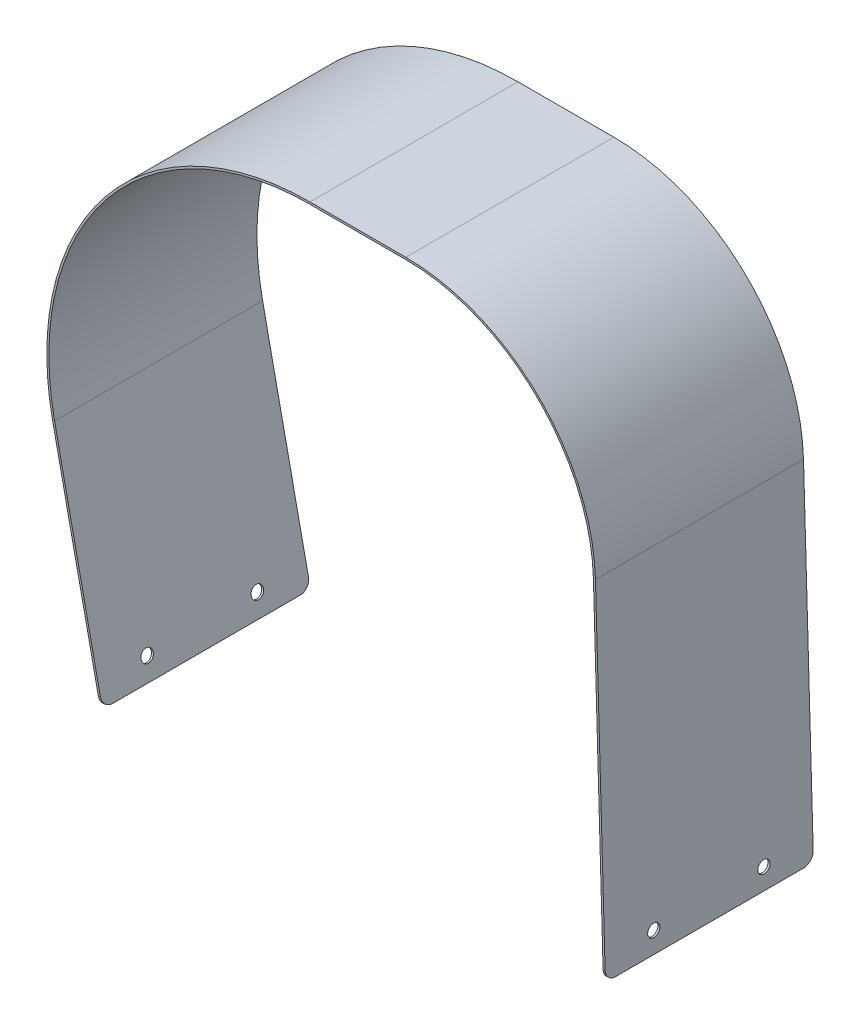
ISO-10303-21;
HEADER;
FILE_DESCRIPTION(('STEP AP214'),'2;1');
FILE_NAME('part.step','',(''),(''),'','','');
FILE_SCHEMA(('AUTOMOTIVE_DESIGN { 1 0 10303 214 1 1 1 1 }'));
ENDSEC;
DATA;
#1=APPLICATION_CONTEXT('core data for automotive mechanical design processes');
#2=APPLICATION_PROTOCOL_DEFINITION('international standard','automotive_design',2000,#1);
#3=PRODUCT_CONTEXT('',#1,'mechanical');
#4=PRODUCT('Part','Part','',(#3));
#5=PRODUCT_RELATED_PRODUCT_CATEGORY('part','',(#4));
#6=PRODUCT_DEFINITION_FORMATION('','',#4);
#7=PRODUCT_DEFINITION_CONTEXT('part definition',#1,'design');
#8=PRODUCT_DEFINITION('design','',#6,#7);
#9=PRODUCT_DEFINITION_SHAPE('','',#8);
#10=(LENGTH_UNIT() NAMED_UNIT(*) SI_UNIT(.MILLI.,.METRE.));
#11=(NAMED_UNIT(*) PLANE_ANGLE_UNIT() SI_UNIT($,.RADIAN.));
#12=(NAMED_UNIT(*) SI_UNIT($,.STERADIAN.) SOLID_ANGLE_UNIT());
#13=UNCERTAINTY_MEASURE_WITH_UNIT(LENGTH_MEASURE(1.E-05),#10,'distance_accuracy_value','');
#14=(GEOMETRIC_REPRESENTATION_CONTEXT(3) GLOBAL_UNCERTAINTY_ASSIGNED_CONTEXT((#13)) GLOBAL_UNIT_ASSIGNED_CONTEXT((#10,
#11,#12)) REPRESENTATION_CONTEXT('',''));
#15=CARTESIAN_POINT('',(0.,0.,0.));
#16=DIRECTION('',(0.,0.,1.));
#17=DIRECTION('',(1.,0.,0.));
#18=AXIS2_PLACEMENT_3D('',#15,#16,#17);
#19=CARTESIAN_POINT('',(135.043499474033,-127.971047058245,102.));
#20=DIRECTION('',(-0.999580775707346,-0.0289529417555443,0.));
#21=DIRECTION('',(0.0289529417555443,-0.999580775707346,0.));
#22=AXIS2_PLACEMENT_3D('',#19,#20,#21);
#23=PLANE('',#22);
#24=CARTESIAN_POINT('',(134.753970056478,-117.975239301171,24.));
#25=DIRECTION('',(0.999580775707346,0.0289529417555443,0.));
#26=DIRECTION('',(-0.0289529417555443,0.999580775707346,0.));
#27=AXIS2_PLACEMENT_3D('',#24,#25,#26);
#28=CIRCLE('',#27,3.00000000000001);
#29=CARTESIAN_POINT('',(134.667111231211,-114.976496974049,24.));
#30=VERTEX_POINT('',#29);
#31=EDGE_CURVE('E338',#30,#30,#28,.T.);
#32=ORIENTED_EDGE('',*,*,#31,.F.);
#33=EDGE_LOOP('',(#32));
#34=FACE_BOUND('',#33,.T.);
#35=DIRECTION('',(-0.0289529417555443,0.999580775707346,0.));
#36=VECTOR('',#35,1.);
#37=CARTESIAN_POINT('',(135.043499474033,-127.971047058245,102.));
#38=LINE('',#37,#36);
#39=CARTESIAN_POINT('',(134.898734765256,-122.973143179708,102.));
#40=VERTEX_POINT('',#39);
#41=CARTESIAN_POINT('',(130.158141981134,40.6926235832663,102.));
#42=VERTEX_POINT('',#41);
#43=EDGE_CURVE('E183',#40,#42,#38,.T.);
#44=ORIENTED_EDGE('',*,*,#43,.F.);
#45=CARTESIAN_POINT('',(134.898734765256,-122.973143179708,97.));
#46=DIRECTION('',(-0.999580775707346,-0.0289529417555443,0.));
#47=DIRECTION('',(0.0289529417555443,-0.999580775707346,0.));
#48=AXIS2_PLACEMENT_3D('',#45,#46,#47);
#49=CIRCLE('',#48,5.);
#50=CARTESIAN_POINT('',(135.043499474033,-127.971047058245,97.));
#51=VERTEX_POINT('',#50);
#52=EDGE_CURVE('E255',#40,#51,#49,.F.);
#53=ORIENTED_EDGE('',*,*,#52,.T.);
#54=DIRECTION('',(0.,0.,-1.));
#55=VECTOR('',#54,1.);
#56=CARTESIAN_POINT('',(135.043499474033,-127.971047058245,102.));
#57=LINE('',#56,#55);
#58=CARTESIAN_POINT('',(135.043499474033,-127.971047058245,5.));
#59=VERTEX_POINT('',#58);
#60=EDGE_CURVE('E226',#51,#59,#57,.T.);
#61=ORIENTED_EDGE('',*,*,#60,.T.);
#62=CARTESIAN_POINT('',(134.898734765256,-122.973143179708,5.));
#63=DIRECTION('',(-0.999580775707346,-0.0289529417555443,0.));
#64=DIRECTION('',(0.0289529417555443,-0.999580775707346,0.));
#65=AXIS2_PLACEMENT_3D('',#62,#63,#64);
#66=CIRCLE('',#65,5.);
#67=CARTESIAN_POINT('',(134.898734765256,-122.973143179708,0.));
#68=VERTEX_POINT('',#67);
#69=EDGE_CURVE('E253',#59,#68,#66,.F.);
#70=ORIENTED_EDGE('',*,*,#69,.T.);
#71=DIRECTION('',(-0.0289529417555443,0.999580775707346,0.));
#72=VECTOR('',#71,1.);
#73=CARTESIAN_POINT('',(135.043499474033,-127.971047058245,0.));
#74=LINE('',#73,#72);
#75=CARTESIAN_POINT('',(130.158141981134,40.6926235832663,0.));
#76=VERTEX_POINT('',#75);
#77=EDGE_CURVE('E207',#68,#76,#74,.T.);
#78=ORIENTED_EDGE('',*,*,#77,.T.);
#79=DIRECTION('',(0.,0.,-1.));
#80=VECTOR('',#79,1.);
#81=CARTESIAN_POINT('',(130.158141981134,40.6926235832663,102.));
#82=LINE('',#81,#80);
#83=EDGE_CURVE('E223',#42,#76,#82,.T.);
#84=ORIENTED_EDGE('',*,*,#83,.F.);
#85=EDGE_LOOP('',(#44,#53,#61,#70,#78,#84));
#86=FACE_BOUND('',#85,.T.);
#87=CARTESIAN_POINT('',(134.753970056478,-117.975239301171,78.));
#88=DIRECTION('',(0.999580775707346,0.0289529417555443,0.));
#89=DIRECTION('',(-0.0289529417555443,0.999580775707346,0.));
#90=AXIS2_PLACEMENT_3D('',#87,#88,#89);
#91=CIRCLE('',#90,3.00000000000002);
#92=CARTESIAN_POINT('',(134.667111231211,-114.976496974049,78.));
#93=VERTEX_POINT('',#92);
#94=EDGE_CURVE('E332',#93,#93,#91,.T.);
#95=ORIENTED_EDGE('',*,*,#94,.F.);
#96=EDGE_LOOP('',(#95));
#97=FACE_BOUND('',#96,.T.);
#98=ADVANCED_FACE('F36',(#34,#86,#97),#23,.F.);
#99=CARTESIAN_POINT('',(-135.993320810657,-24.7762985585289,102.));
#100=DIRECTION('',(0.978220547682233,0.207568205880071,0.));
#101=DIRECTION('',(-0.207568205880071,0.978220547682233,0.));
#102=AXIS2_PLACEMENT_3D('',#99,#100,#101);
#103=PLANE('',#102);
#104=CARTESIAN_POINT('',(-114.576735795129,-125.707669211111,78.));
#105=DIRECTION('',(-0.978220547682233,-0.207568205880071,0.));
#106=DIRECTION('',(0.207568205880071,-0.978220547682233,0.));
#107=AXIS2_PLACEMENT_3D('',#104,#105,#106);
#108=CIRCLE('',#107,3.00000000000002);
#109=CARTESIAN_POINT('',(-113.954031177489,-128.642330854158,78.));
#110=VERTEX_POINT('',#109);
#111=EDGE_CURVE('E350',#110,#110,#108,.T.);
#112=ORIENTED_EDGE('',*,*,#111,.F.);
#113=EDGE_LOOP('',(#112));
#114=FACE_BOUND('',#113,.T.);
#115=CARTESIAN_POINT('',(-114.576735795129,-125.707669211111,24.));
#116=DIRECTION('',(-0.978220547682233,-0.207568205880071,0.));
#117=DIRECTION('',(0.207568205880071,-0.978220547682233,0.));
#118=AXIS2_PLACEMENT_3D('',#115,#116,#117);
#119=CIRCLE('',#118,3.00000000000001);
#120=CARTESIAN_POINT('',(-113.954031177489,-128.642330854158,24.));
#121=VERTEX_POINT('',#120);
#122=EDGE_CURVE('E344',#121,#121,#119,.T.);
#123=ORIENTED_EDGE('',*,*,#122,.F.);
#124=EDGE_LOOP('',(#123));
#125=FACE_BOUND('',#124,.T.);
#126=DIRECTION('',(0.207568205880071,-0.978220547682233,0.));
#127=VECTOR('',#126,1.);
#128=CARTESIAN_POINT('',(-135.993320810657,-24.7762985585289,0.));
#129=LINE('',#128,#127);
#130=CARTESIAN_POINT('',(-135.993320810657,-24.7762985585289,0.));
#131=VERTEX_POINT('',#130);
#132=CARTESIAN_POINT('',(-113.538894765729,-130.598771949522,0.));
#133=VERTEX_POINT('',#132);
#134=EDGE_CURVE('E192',#131,#133,#129,.T.);
#135=ORIENTED_EDGE('',*,*,#134,.T.);
#136=CARTESIAN_POINT('',(-113.538894765729,-130.598771949522,5.));
#137=DIRECTION('',(0.978220547682233,0.207568205880071,0.));
#138=DIRECTION('',(-0.207568205880071,0.978220547682233,0.));
#139=AXIS2_PLACEMENT_3D('',#136,#137,#138);
#140=CIRCLE('',#139,5.);
#141=CARTESIAN_POINT('',(-112.501053736329,-135.489874687933,5.));
#142=VERTEX_POINT('',#141);
#143=EDGE_CURVE('E265',#133,#142,#140,.F.);
#144=ORIENTED_EDGE('',*,*,#143,.T.);
#145=DIRECTION('',(0.,0.,-1.));
#146=VECTOR('',#145,1.);
#147=CARTESIAN_POINT('',(-112.501053736329,-135.489874687933,102.));
#148=LINE('',#147,#146);
#149=CARTESIAN_POINT('',(-112.501053736329,-135.489874687933,97.));
#150=VERTEX_POINT('',#149);
#151=EDGE_CURVE('E239',#150,#142,#148,.T.);
#152=ORIENTED_EDGE('',*,*,#151,.F.);
#153=CARTESIAN_POINT('',(-113.538894765729,-130.598771949522,97.));
#154=DIRECTION('',(0.978220547682233,0.207568205880071,0.));
#155=DIRECTION('',(-0.207568205880071,0.978220547682233,0.));
#156=AXIS2_PLACEMENT_3D('',#153,#154,#155);
#157=CIRCLE('',#156,5.);
#158=CARTESIAN_POINT('',(-113.538894765729,-130.598771949522,102.));
#159=VERTEX_POINT('',#158);
#160=EDGE_CURVE('E263',#150,#159,#157,.F.);
#161=ORIENTED_EDGE('',*,*,#160,.T.);
#162=DIRECTION('',(0.207568205880071,-0.978220547682233,0.));
#163=VECTOR('',#162,1.);
#164=CARTESIAN_POINT('',(-135.993320810657,-24.7762985585289,102.));
#165=LINE('',#164,#163);
#166=CARTESIAN_POINT('',(-135.993320810657,-24.7762985585289,102.));
#167=VERTEX_POINT('',#166);
#168=EDGE_CURVE('E170',#167,#159,#165,.T.);
#169=ORIENTED_EDGE('',*,*,#168,.F.);
#170=DIRECTION('',(0.,0.,-1.));
#171=VECTOR('',#170,1.);
#172=CARTESIAN_POINT('',(-135.993320810657,-24.7762985585289,102.));
#173=LINE('',#172,#171);
#174=EDGE_CURVE('E191',#167,#131,#173,.T.);
#175=ORIENTED_EDGE('',*,*,#174,.T.);
#176=EDGE_LOOP('',(#135,#144,#152,#161,#169,#175));
#177=FACE_BOUND('',#176,.T.);
#178=ADVANCED_FACE('F275',(#114,#125,#177),#103,.F.);
#179=CARTESIAN_POINT('',(-111.522833188646,-135.282306482053,102.));
#180=DIRECTION('',(0.207568205880111,-0.978220547682225,0.));
#181=DIRECTION('',(0.978220547682225,0.207568205880111,0.));
#182=AXIS2_PLACEMENT_3D('',#179,#180,#181);
#183=PLANE('',#182);
#184=ORIENTED_EDGE('',*,*,#151,.T.);
#185=DIRECTION('',(-0.978220547682225,-0.207568205880111,0.));
#186=VECTOR('',#185,1.);
#187=CARTESIAN_POINT('',(-111.522833188646,-135.282306482053,5.));
#188=LINE('',#187,#186);
#189=CARTESIAN_POINT('',(-111.522833188646,-135.282306482053,5.));
#190=VERTEX_POINT('',#189);
#191=EDGE_CURVE('E51',#142,#190,#188,.F.);
#192=ORIENTED_EDGE('',*,*,#191,.T.);
#193=DIRECTION('',(0.,0.,-1.));
#194=VECTOR('',#193,1.);
#195=CARTESIAN_POINT('',(-111.522833188646,-135.282306482053,102.));
#196=LINE('',#195,#194);
#197=CARTESIAN_POINT('',(-111.522833188646,-135.282306482053,97.));
#198=VERTEX_POINT('',#197);
#199=EDGE_CURVE('E157',#198,#190,#196,.T.);
#200=ORIENTED_EDGE('',*,*,#199,.F.);
#201=DIRECTION('',(-0.978220547682225,-0.207568205880111,0.));
#202=VECTOR('',#201,1.);
#203=CARTESIAN_POINT('',(-111.522833188646,-135.282306482053,97.));
#204=LINE('',#203,#202);
#205=EDGE_CURVE('E267',#198,#150,#204,.T.);
#206=ORIENTED_EDGE('',*,*,#205,.T.);
#207=EDGE_LOOP('',(#184,#192,#200,#206));
#208=FACE_BOUND('',#207,.T.);
#209=ADVANCED_FACE('F272',(#208),#183,.T.);
#210=CARTESIAN_POINT('',(-135.015100262975,-24.5687303526489,102.));
#211=DIRECTION('',(0.978220547682233,0.207568205880071,0.));
#212=DIRECTION('',(-0.207568205880071,0.978220547682233,0.));
#213=AXIS2_PLACEMENT_3D('',#210,#211,#212);
#214=PLANE('',#213);
#215=CARTESIAN_POINT('',(-113.598515247447,-125.500101005231,78.));
#216=DIRECTION('',(0.978220547682233,0.207568205880071,0.));
#217=DIRECTION('',(-0.207568205880071,0.978220547682233,0.));
#218=AXIS2_PLACEMENT_3D('',#215,#216,#217);
#219=CIRCLE('',#218,3.00000000000002);
#220=CARTESIAN_POINT('',(-114.221219865087,-122.565439362184,78.));
#221=VERTEX_POINT('',#220);
#222=EDGE_CURVE('E347',#221,#221,#219,.T.);
#223=ORIENTED_EDGE('',*,*,#222,.F.);
#224=EDGE_LOOP('',(#223));
#225=FACE_BOUND('',#224,.T.);
#226=CARTESIAN_POINT('',(-113.598515247447,-125.500101005231,24.));
#227=DIRECTION('',(0.978220547682233,0.207568205880071,0.));
#228=DIRECTION('',(-0.207568205880071,0.978220547682233,0.));
#229=AXIS2_PLACEMENT_3D('',#226,#227,#228);
#230=CIRCLE('',#229,3.00000000000001);
#231=CARTESIAN_POINT('',(-114.221219865087,-122.565439362184,24.));
#232=VERTEX_POINT('',#231);
#233=EDGE_CURVE('E341',#232,#232,#230,.T.);
#234=ORIENTED_EDGE('',*,*,#233,.F.);
#235=EDGE_LOOP('',(#234));
#236=FACE_BOUND('',#235,.T.);
#237=ORIENTED_EDGE('',*,*,#199,.T.);
#238=CARTESIAN_POINT('',(-112.560674218047,-130.391203743642,5.));
#239=DIRECTION('',(0.978220547682233,0.207568205880071,0.));
#240=DIRECTION('',(-0.207568205880071,0.978220547682233,0.));
#241=AXIS2_PLACEMENT_3D('',#238,#239,#240);
#242=CIRCLE('',#241,5.);
#243=CARTESIAN_POINT('',(-112.560674218047,-130.391203743642,0.));
#244=VERTEX_POINT('',#243);
#245=EDGE_CURVE('E11',#190,#244,#242,.T.);
#246=ORIENTED_EDGE('',*,*,#245,.T.);
#247=DIRECTION('',(0.207568205880071,-0.978220547682233,0.));
#248=VECTOR('',#247,1.);
#249=CARTESIAN_POINT('',(-135.015100262975,-24.5687303526489,0.));
#250=LINE('',#249,#248);
#251=CARTESIAN_POINT('',(-135.015100262975,-24.5687303526488,0.));
#252=VERTEX_POINT('',#251);
#253=EDGE_CURVE('E152',#252,#244,#250,.T.);
#254=ORIENTED_EDGE('',*,*,#253,.F.);
#255=DIRECTION('',(0.,0.,-1.));
#256=VECTOR('',#255,1.);
#257=CARTESIAN_POINT('',(-135.015100262975,-24.5687303526488,102.));
#258=LINE('',#257,#256);
#259=CARTESIAN_POINT('',(-135.015100262975,-24.5687303526488,102.));
#260=VERTEX_POINT('',#259);
#261=EDGE_CURVE('E147',#260,#252,#258,.T.);
#262=ORIENTED_EDGE('',*,*,#261,.F.);
#263=DIRECTION('',(0.207568205880071,-0.978220547682233,0.));
#264=VECTOR('',#263,1.);
#265=CARTESIAN_POINT('',(-135.015100262975,-24.5687303526489,102.));
#266=LINE('',#265,#264);
#267=CARTESIAN_POINT('',(-112.560674218047,-130.391203743642,102.));
#268=VERTEX_POINT('',#267);
#269=EDGE_CURVE('E150',#260,#268,#266,.T.);
#270=ORIENTED_EDGE('',*,*,#269,.T.);
#271=CARTESIAN_POINT('',(-112.560674218047,-130.391203743642,97.));
#272=DIRECTION('',(0.978220547682233,0.207568205880071,0.));
#273=DIRECTION('',(-0.207568205880071,0.978220547682233,0.));
#274=AXIS2_PLACEMENT_3D('',#271,#272,#273);
#275=CIRCLE('',#274,5.);
#276=EDGE_CURVE('E44',#268,#198,#275,.T.);
#277=ORIENTED_EDGE('',*,*,#276,.T.);
#278=EDGE_LOOP('',(#237,#246,#254,#262,#270,#277));
#279=FACE_BOUND('',#278,.T.);
#280=ADVANCED_FACE('F149',(#225,#236,#279),#214,.T.);
#281=CARTESIAN_POINT('',(-9.80287015964917,2.,102.));
#282=DIRECTION('',(0.,0.,-1.));
#283=DIRECTION('',(-1.,0.,0.));
#284=AXIS2_PLACEMENT_3D('',#281,#282,#283);
#285=CYLINDRICAL_SURFACE('',#284,128.);
#286=CARTESIAN_POINT('',(-9.80287015964917,2.,0.));
#287=DIRECTION('',(0.,0.,1.));
#288=DIRECTION('',(1.,0.,0.));
#289=AXIS2_PLACEMENT_3D('',#286,#287,#288);
#290=CIRCLE('',#289,128.);
#291=CARTESIAN_POINT('',(-9.80287015964917,130.,0.));
#292=VERTEX_POINT('',#291);
#293=EDGE_CURVE('E197',#292,#252,#290,.T.);
#294=ORIENTED_EDGE('',*,*,#293,.F.);
#295=DIRECTION('',(0.,0.,-1.));
#296=VECTOR('',#295,1.);
#297=CARTESIAN_POINT('',(-9.80287015964917,130.,102.));
#298=LINE('',#297,#296);
#299=CARTESIAN_POINT('',(-9.80287015964917,130.,102.));
#300=VERTEX_POINT('',#299);
#301=EDGE_CURVE('E158',#300,#292,#298,.T.);
#302=ORIENTED_EDGE('',*,*,#301,.F.);
#303=CARTESIAN_POINT('',(-9.80287015964917,2.,102.));
#304=DIRECTION('',(0.,0.,1.));
#305=DIRECTION('',(1.,0.,0.));
#306=AXIS2_PLACEMENT_3D('',#303,#304,#305);
#307=CIRCLE('',#306,128.);
#308=EDGE_CURVE('E165',#300,#260,#307,.T.);
#309=ORIENTED_EDGE('',*,*,#308,.T.);
#310=ORIENTED_EDGE('',*,*,#261,.T.);
#311=EDGE_LOOP('',(#294,#302,#309,#310));
#312=FACE_BOUND('',#311,.T.);
#313=ADVANCED_FACE('F172',(#312),#285,.F.);
#314=CARTESIAN_POINT('',(37.1971298403508,130.,102.));
#315=DIRECTION('',(0.,-1.,0.));
#316=DIRECTION('',(1.,0.,0.));
#317=AXIS2_PLACEMENT_3D('',#314,#315,#316);
#318=PLANE('',#317);
#319=DIRECTION('',(-1.,0.,0.));
#320=VECTOR('',#319,1.);
#321=CARTESIAN_POINT('',(37.1971298403508,130.,0.));
#322=LINE('',#321,#320);
#323=CARTESIAN_POINT('',(37.1971298403508,130.,0.));
#324=VERTEX_POINT('',#323);
#325=EDGE_CURVE('E199',#324,#292,#322,.T.);
#326=ORIENTED_EDGE('',*,*,#325,.F.);
#327=DIRECTION('',(0.,0.,-1.));
#328=VECTOR('',#327,1.);
#329=CARTESIAN_POINT('',(37.1971298403508,130.,102.));
#330=LINE('',#329,#328);
#331=CARTESIAN_POINT('',(37.1971298403508,130.,102.));
#332=VERTEX_POINT('',#331);
#333=EDGE_CURVE('E235',#332,#324,#330,.T.);
#334=ORIENTED_EDGE('',*,*,#333,.F.);
#335=DIRECTION('',(-1.,0.,0.));
#336=VECTOR('',#335,1.);
#337=CARTESIAN_POINT('',(37.1971298403508,130.,102.));
#338=LINE('',#337,#336);
#339=EDGE_CURVE('E173',#332,#300,#338,.T.);
#340=ORIENTED_EDGE('',*,*,#339,.T.);
#341=ORIENTED_EDGE('',*,*,#301,.T.);
#342=EDGE_LOOP('',(#326,#334,#340,#341));
#343=FACE_BOUND('',#342,.T.);
#344=ADVANCED_FACE('F289',(#343),#318,.T.);
#345=CARTESIAN_POINT('',(37.1971298403508,38.,102.));
#346=DIRECTION('',(0.,0.,-1.));
#347=DIRECTION('',(-1.,0.,0.));
#348=AXIS2_PLACEMENT_3D('',#345,#346,#347);
#349=CYLINDRICAL_SURFACE('',#348,92.);
#350=CARTESIAN_POINT('',(37.1971298403508,38.,0.));
#351=DIRECTION('',(0.,0.,1.));
#352=DIRECTION('',(-1.,0.,0.));
#353=AXIS2_PLACEMENT_3D('',#350,#351,#352);
#354=CIRCLE('',#353,92.);
#355=CARTESIAN_POINT('',(129.158561205427,40.6636706415108,0.));
#356=VERTEX_POINT('',#355);
#357=EDGE_CURVE('E202',#356,#324,#354,.T.);
#358=ORIENTED_EDGE('',*,*,#357,.F.);
#359=DIRECTION('',(0.,0.,-1.));
#360=VECTOR('',#359,1.);
#361=CARTESIAN_POINT('',(129.158561205427,40.6636706415108,102.));
#362=LINE('',#361,#360);
#363=CARTESIAN_POINT('',(129.158561205427,40.6636706415108,102.));
#364=VERTEX_POINT('',#363);
#365=EDGE_CURVE('E232',#364,#356,#362,.T.);
#366=ORIENTED_EDGE('',*,*,#365,.F.);
#367=CARTESIAN_POINT('',(37.1971298403508,38.,102.));
#368=DIRECTION('',(0.,0.,1.));
#369=DIRECTION('',(-1.,0.,0.));
#370=AXIS2_PLACEMENT_3D('',#367,#368,#369);
#371=CIRCLE('',#370,92.);
#372=EDGE_CURVE('E175',#364,#332,#371,.T.);
#373=ORIENTED_EDGE('',*,*,#372,.T.);
#374=ORIENTED_EDGE('',*,*,#333,.T.);
#375=EDGE_LOOP('',(#358,#366,#373,#374));
#376=FACE_BOUND('',#375,.T.);
#377=ADVANCED_FACE('F293',(#376),#349,.F.);
#378=CARTESIAN_POINT('',(134.043918698326,-128.,102.));
#379=DIRECTION('',(-0.999580775707346,-0.0289529417555443,0.));
#380=DIRECTION('',(0.0289529417555443,-0.999580775707346,0.));
#381=AXIS2_PLACEMENT_3D('',#378,#379,#380);
#382=PLANE('',#381);
#383=CARTESIAN_POINT('',(133.754389280771,-118.004192242927,24.));
#384=DIRECTION('',(-0.999580775707346,-0.0289529417555443,0.));
#385=DIRECTION('',(0.0289529417555443,-0.999580775707346,0.));
#386=AXIS2_PLACEMENT_3D('',#383,#384,#385);
#387=CIRCLE('',#386,3.00000000000001);
#388=CARTESIAN_POINT('',(133.841248106037,-121.002934570049,24.));
#389=VERTEX_POINT('',#388);
#390=EDGE_CURVE('E335',#389,#389,#387,.T.);
#391=ORIENTED_EDGE('',*,*,#390,.F.);
#392=EDGE_LOOP('',(#391));
#393=FACE_BOUND('',#392,.T.);
#394=CARTESIAN_POINT('',(133.754389280771,-118.004192242927,78.));
#395=DIRECTION('',(-0.999580775707346,-0.0289529417555443,0.));
#396=DIRECTION('',(0.0289529417555443,-0.999580775707346,0.));
#397=AXIS2_PLACEMENT_3D('',#394,#395,#396);
#398=CIRCLE('',#397,3.00000000000002);
#399=CARTESIAN_POINT('',(133.841248106037,-121.002934570049,78.));
#400=VERTEX_POINT('',#399);
#401=EDGE_CURVE('E195',#400,#400,#398,.T.);
#402=ORIENTED_EDGE('',*,*,#401,.F.);
#403=EDGE_LOOP('',(#402));
#404=FACE_BOUND('',#403,.T.);
#405=DIRECTION('',(0.,0.,-1.));
#406=VECTOR('',#405,1.);
#407=CARTESIAN_POINT('',(134.043918698326,-128.,102.));
#408=LINE('',#407,#406);
#409=CARTESIAN_POINT('',(134.043918698326,-128.,97.));
#410=VERTEX_POINT('',#409);
#411=CARTESIAN_POINT('',(134.043918698326,-128.,5.));
#412=VERTEX_POINT('',#411);
#413=EDGE_CURVE('E229',#410,#412,#408,.T.);
#414=ORIENTED_EDGE('',*,*,#413,.F.);
#415=CARTESIAN_POINT('',(133.899153989548,-123.002096121463,97.));
#416=DIRECTION('',(-0.999580775707346,-0.0289529417555443,0.));
#417=DIRECTION('',(0.0289529417555443,-0.999580775707346,0.));
#418=AXIS2_PLACEMENT_3D('',#415,#416,#417);
#419=CIRCLE('',#418,5.);
#420=CARTESIAN_POINT('',(133.899153989548,-123.002096121463,102.));
#421=VERTEX_POINT('',#420);
#422=EDGE_CURVE('E248',#410,#421,#419,.T.);
#423=ORIENTED_EDGE('',*,*,#422,.T.);
#424=DIRECTION('',(-0.0289529417555443,0.999580775707346,0.));
#425=VECTOR('',#424,1.);
#426=CARTESIAN_POINT('',(134.043918698326,-128.,102.));
#427=LINE('',#426,#425);
#428=EDGE_CURVE('E181',#421,#364,#427,.T.);
#429=ORIENTED_EDGE('',*,*,#428,.T.);
#430=ORIENTED_EDGE('',*,*,#365,.T.);
#431=DIRECTION('',(-0.0289529417555443,0.999580775707346,0.));
#432=VECTOR('',#431,1.);
#433=CARTESIAN_POINT('',(134.043918698326,-128.,0.));
#434=LINE('',#433,#432);
#435=CARTESIAN_POINT('',(133.899153989548,-123.002096121463,0.));
#436=VERTEX_POINT('',#435);
#437=EDGE_CURVE('E205',#436,#356,#434,.T.);
#438=ORIENTED_EDGE('',*,*,#437,.F.);
#439=CARTESIAN_POINT('',(133.899153989548,-123.002096121463,5.));
#440=DIRECTION('',(-0.999580775707346,-0.0289529417555443,0.));
#441=DIRECTION('',(0.0289529417555443,-0.999580775707346,0.));
#442=AXIS2_PLACEMENT_3D('',#439,#440,#441);
#443=CIRCLE('',#442,5.);
#444=EDGE_CURVE('E246',#436,#412,#443,.T.);
#445=ORIENTED_EDGE('',*,*,#444,.T.);
#446=EDGE_LOOP('',(#414,#423,#429,#430,#438,#445));
#447=FACE_BOUND('',#446,.T.);
#448=ADVANCED_FACE('F297',(#393,#404,#447),#382,.T.);
#449=CARTESIAN_POINT('',(135.043499474033,-127.971047058245,102.));
#450=DIRECTION('',(0.0289529417555331,-0.999580775707347,0.));
#451=DIRECTION('',(0.999580775707347,0.0289529417555331,0.));
#452=AXIS2_PLACEMENT_3D('',#449,#450,#451);
#453=PLANE('',#452);
#454=ORIENTED_EDGE('',*,*,#60,.F.);
#455=DIRECTION('',(-0.999580775707347,-0.0289529417555331,0.));
#456=VECTOR('',#455,1.);
#457=CARTESIAN_POINT('',(135.043499474033,-127.971047058245,97.));
#458=LINE('',#457,#456);
#459=EDGE_CURVE('E243',#51,#410,#458,.T.);
#460=ORIENTED_EDGE('',*,*,#459,.T.);
#461=ORIENTED_EDGE('',*,*,#413,.T.);
#462=DIRECTION('',(-0.999580775707347,-0.0289529417555331,0.));
#463=VECTOR('',#462,1.);
#464=CARTESIAN_POINT('',(135.043499474033,-127.971047058245,5.));
#465=LINE('',#464,#463);
#466=EDGE_CURVE('E241',#412,#59,#465,.F.);
#467=ORIENTED_EDGE('',*,*,#466,.T.);
#468=EDGE_LOOP('',(#454,#460,#461,#467));
#469=FACE_BOUND('',#468,.T.);
#470=ADVANCED_FACE('F310',(#469),#453,.T.);
#471=CARTESIAN_POINT('',(37.1971298403508,38.,102.));
#472=DIRECTION('',(0.,0.,-1.));
#473=DIRECTION('',(-1.,0.,0.));
#474=AXIS2_PLACEMENT_3D('',#471,#472,#473);
#475=CYLINDRICAL_SURFACE('',#474,93.);
#476=CARTESIAN_POINT('',(37.1971298403508,38.,0.));
#477=DIRECTION('',(0.,0.,1.));
#478=DIRECTION('',(1.,0.,0.));
#479=AXIS2_PLACEMENT_3D('',#476,#477,#478);
#480=CIRCLE('',#479,93.);
#481=CARTESIAN_POINT('',(37.1971298403508,131.,0.));
#482=VERTEX_POINT('',#481);
#483=EDGE_CURVE('E209',#76,#482,#480,.T.);
#484=ORIENTED_EDGE('',*,*,#483,.T.);
#485=DIRECTION('',(0.,0.,-1.));
#486=VECTOR('',#485,1.);
#487=CARTESIAN_POINT('',(37.1971298403508,131.,102.));
#488=LINE('',#487,#486);
#489=CARTESIAN_POINT('',(37.1971298403508,131.,102.));
#490=VERTEX_POINT('',#489);
#491=EDGE_CURVE('E220',#490,#482,#488,.T.);
#492=ORIENTED_EDGE('',*,*,#491,.F.);
#493=CARTESIAN_POINT('',(37.1971298403508,38.,102.));
#494=DIRECTION('',(0.,0.,1.));
#495=DIRECTION('',(1.,0.,0.));
#496=AXIS2_PLACEMENT_3D('',#493,#494,#495);
#497=CIRCLE('',#496,93.);
#498=EDGE_CURVE('E185',#42,#490,#497,.T.);
#499=ORIENTED_EDGE('',*,*,#498,.F.);
#500=ORIENTED_EDGE('',*,*,#83,.T.);
#501=EDGE_LOOP('',(#484,#492,#499,#500));
#502=FACE_BOUND('',#501,.T.);
#503=ADVANCED_FACE('F319',(#502),#475,.T.);
#504=CARTESIAN_POINT('',(37.1971298403508,131.,102.));
#505=DIRECTION('',(0.,-1.,0.));
#506=DIRECTION('',(1.,0.,0.));
#507=AXIS2_PLACEMENT_3D('',#504,#505,#506);
#508=PLANE('',#507);
#509=DIRECTION('',(-1.,0.,0.));
#510=VECTOR('',#509,1.);
#511=CARTESIAN_POINT('',(37.1971298403508,131.,0.));
#512=LINE('',#511,#510);
#513=CARTESIAN_POINT('',(-9.80287015964917,131.,0.));
#514=VERTEX_POINT('',#513);
#515=EDGE_CURVE('E211',#482,#514,#512,.T.);
#516=ORIENTED_EDGE('',*,*,#515,.T.);
#517=DIRECTION('',(0.,0.,-1.));
#518=VECTOR('',#517,1.);
#519=CARTESIAN_POINT('',(-9.80287015964917,131.,102.));
#520=LINE('',#519,#518);
#521=CARTESIAN_POINT('',(-9.80287015964917,131.,102.));
#522=VERTEX_POINT('',#521);
#523=EDGE_CURVE('E217',#522,#514,#520,.T.);
#524=ORIENTED_EDGE('',*,*,#523,.F.);
#525=DIRECTION('',(-1.,0.,0.));
#526=VECTOR('',#525,1.);
#527=CARTESIAN_POINT('',(37.1971298403508,131.,102.));
#528=LINE('',#527,#526);
#529=EDGE_CURVE('E187',#490,#522,#528,.T.);
#530=ORIENTED_EDGE('',*,*,#529,.F.);
#531=ORIENTED_EDGE('',*,*,#491,.T.);
#532=EDGE_LOOP('',(#516,#524,#530,#531));
#533=FACE_BOUND('',#532,.T.);
#534=ADVANCED_FACE('F323',(#533),#508,.F.);
#535=CARTESIAN_POINT('',(-9.80287015964917,2.,102.));
#536=DIRECTION('',(0.,0.,-1.));
#537=DIRECTION('',(-1.,0.,0.));
#538=AXIS2_PLACEMENT_3D('',#535,#536,#537);
#539=CYLINDRICAL_SURFACE('',#538,129.);
#540=CARTESIAN_POINT('',(-9.80287015964917,2.,0.));
#541=DIRECTION('',(0.,0.,1.));
#542=DIRECTION('',(1.,0.,0.));
#543=AXIS2_PLACEMENT_3D('',#540,#541,#542);
#544=CIRCLE('',#543,129.);
#545=EDGE_CURVE('E213',#514,#131,#544,.T.);
#546=ORIENTED_EDGE('',*,*,#545,.T.);
#547=ORIENTED_EDGE('',*,*,#174,.F.);
#548=CARTESIAN_POINT('',(-9.80287015964917,2.,102.));
#549=DIRECTION('',(0.,0.,1.));
#550=DIRECTION('',(1.,0.,0.));
#551=AXIS2_PLACEMENT_3D('',#548,#549,#550);
#552=CIRCLE('',#551,129.);
#553=EDGE_CURVE('E189',#522,#167,#552,.T.);
#554=ORIENTED_EDGE('',*,*,#553,.F.);
#555=ORIENTED_EDGE('',*,*,#523,.T.);
#556=EDGE_LOOP('',(#546,#547,#554,#555));
#557=FACE_BOUND('',#556,.T.);
#558=ADVANCED_FACE('F328',(#557),#539,.T.);
#559=CARTESIAN_POINT('',(-9.80287015964917,2.,102.));
#560=DIRECTION('',(0.,0.,1.));
#561=DIRECTION('',(1.,0.,0.));
#562=AXIS2_PLACEMENT_3D('',#559,#560,#561);
#563=PLANE('',#562);
#564=ORIENTED_EDGE('',*,*,#428,.F.);
#565=DIRECTION('',(-0.999580775707347,-0.0289529417555331,0.));
#566=VECTOR('',#565,1.);
#567=CARTESIAN_POINT('',(-6.06474749546762,-127.056162372092,102.));
#568=LINE('',#567,#566);
#569=EDGE_CURVE('E251',#421,#40,#568,.F.);
#570=ORIENTED_EDGE('',*,*,#569,.T.);
#571=ORIENTED_EDGE('',*,*,#43,.T.);
#572=ORIENTED_EDGE('',*,*,#498,.T.);
#573=ORIENTED_EDGE('',*,*,#529,.T.);
#574=ORIENTED_EDGE('',*,*,#553,.T.);
#575=ORIENTED_EDGE('',*,*,#168,.T.);
#576=DIRECTION('',(-0.978220547682225,-0.207568205880111,0.));
#577=VECTOR('',#576,1.);
#578=CARTESIAN_POINT('',(12.6515558852824,-103.822473390987,102.));
#579=LINE('',#578,#577);
#580=EDGE_CURVE('E169',#159,#268,#579,.F.);
#581=ORIENTED_EDGE('',*,*,#580,.T.);
#582=ORIENTED_EDGE('',*,*,#269,.F.);
#583=ORIENTED_EDGE('',*,*,#308,.F.);
#584=ORIENTED_EDGE('',*,*,#339,.F.);
#585=ORIENTED_EDGE('',*,*,#372,.F.);
#586=EDGE_LOOP('',(#564,#570,#571,#572,#573,#574,#575,#581,#582,#583,#584,#585));
#587=FACE_BOUND('',#586,.T.);
#588=ADVANCED_FACE('F163',(#587),#563,.T.);
#589=CARTESIAN_POINT('',(-9.80287015964917,2.,0.));
#590=DIRECTION('',(0.,0.,1.));
#591=DIRECTION('',(1.,0.,0.));
#592=AXIS2_PLACEMENT_3D('',#589,#590,#591);
#593=PLANE('',#592);
#594=ORIENTED_EDGE('',*,*,#77,.F.);
#595=DIRECTION('',(-0.999580775707347,-0.0289529417555331,0.));
#596=VECTOR('',#595,1.);
#597=CARTESIAN_POINT('',(133.899153989548,-123.002096121463,0.));
#598=LINE('',#597,#596);
#599=EDGE_CURVE('E260',#68,#436,#598,.T.);
#600=ORIENTED_EDGE('',*,*,#599,.T.);
#601=ORIENTED_EDGE('',*,*,#437,.T.);
#602=ORIENTED_EDGE('',*,*,#357,.T.);
#603=ORIENTED_EDGE('',*,*,#325,.T.);
#604=ORIENTED_EDGE('',*,*,#293,.T.);
#605=ORIENTED_EDGE('',*,*,#253,.T.);
#606=DIRECTION('',(-0.978220547682225,-0.207568205880111,0.));
#607=VECTOR('',#606,1.);
#608=CARTESIAN_POINT('',(-113.538894765729,-130.598771949522,0.));
#609=LINE('',#608,#607);
#610=EDGE_CURVE('E257',#244,#133,#609,.T.);
#611=ORIENTED_EDGE('',*,*,#610,.T.);
#612=ORIENTED_EDGE('',*,*,#134,.F.);
#613=ORIENTED_EDGE('',*,*,#545,.F.);
#614=ORIENTED_EDGE('',*,*,#515,.F.);
#615=ORIENTED_EDGE('',*,*,#483,.F.);
#616=EDGE_LOOP('',(#594,#600,#601,#602,#603,#604,#605,#611,#612,#613,#614,#615));
#617=FACE_BOUND('',#616,.T.);
#618=ADVANCED_FACE('F284',(#617),#593,.F.);
#619=CARTESIAN_POINT('',(134.753970056478,-117.975239301171,78.));
#620=DIRECTION('',(0.999580775707346,0.0289529417555443,0.));
#621=DIRECTION('',(-0.0289529417555443,0.999580775707346,0.));
#622=AXIS2_PLACEMENT_3D('',#619,#620,#621);
#623=CYLINDRICAL_SURFACE('',#622,3.00000000000002);
#624=ORIENTED_EDGE('',*,*,#94,.T.);
#625=EDGE_LOOP('',(#624));
#626=FACE_BOUND('',#625,.T.);
#627=ORIENTED_EDGE('',*,*,#401,.T.);
#628=EDGE_LOOP('',(#627));
#629=FACE_BOUND('',#628,.T.);
#630=ADVANCED_FACE('F441',(#626,#629),#623,.F.);
#631=CARTESIAN_POINT('',(134.753970056478,-117.975239301171,24.));
#632=DIRECTION('',(0.999580775707346,0.0289529417555443,0.));
#633=DIRECTION('',(-0.0289529417555443,0.999580775707346,0.));
#634=AXIS2_PLACEMENT_3D('',#631,#632,#633);
#635=CYLINDRICAL_SURFACE('',#634,3.00000000000001);
#636=ORIENTED_EDGE('',*,*,#31,.T.);
#637=EDGE_LOOP('',(#636));
#638=FACE_BOUND('',#637,.T.);
#639=ORIENTED_EDGE('',*,*,#390,.T.);
#640=EDGE_LOOP('',(#639));
#641=FACE_BOUND('',#640,.T.);
#642=ADVANCED_FACE('F448',(#638,#641),#635,.F.);
#643=CARTESIAN_POINT('',(134.898734765256,-122.973143179708,97.));
#644=DIRECTION('',(-0.999580775707347,-0.0289529417555331,0.));
#645=DIRECTION('',(0.0289529417555331,-0.999580775707347,0.));
#646=AXIS2_PLACEMENT_3D('',#643,#644,#645);
#647=CYLINDRICAL_SURFACE('',#646,5.);
#648=ORIENTED_EDGE('',*,*,#52,.F.);
#649=ORIENTED_EDGE('',*,*,#569,.F.);
#650=ORIENTED_EDGE('',*,*,#422,.F.);
#651=ORIENTED_EDGE('',*,*,#459,.F.);
#652=EDGE_LOOP('',(#648,#649,#650,#651));
#653=FACE_BOUND('',#652,.T.);
#654=ADVANCED_FACE('F302',(#653),#647,.T.);
#655=CARTESIAN_POINT('',(-6.06474749546762,-127.056162372092,5.));
#656=DIRECTION('',(0.999580775707347,0.0289529417555331,0.));
#657=DIRECTION('',(-0.0289529417555331,0.999580775707347,0.));
#658=AXIS2_PLACEMENT_3D('',#655,#656,#657);
#659=CYLINDRICAL_SURFACE('',#658,5.);
#660=ORIENTED_EDGE('',*,*,#69,.F.);
#661=ORIENTED_EDGE('',*,*,#466,.F.);
#662=ORIENTED_EDGE('',*,*,#444,.F.);
#663=ORIENTED_EDGE('',*,*,#599,.F.);
#664=EDGE_LOOP('',(#660,#661,#662,#663));
#665=FACE_BOUND('',#664,.T.);
#666=ADVANCED_FACE('F313',(#665),#659,.T.);
#667=CARTESIAN_POINT('',(12.6515558852824,-103.822473390987,5.));
#668=DIRECTION('',(0.978220547682225,0.207568205880111,0.));
#669=DIRECTION('',(-0.207568205880111,0.978220547682225,0.));
#670=AXIS2_PLACEMENT_3D('',#667,#668,#669);
#671=CYLINDRICAL_SURFACE('',#670,5.);
#672=ORIENTED_EDGE('',*,*,#245,.F.);
#673=ORIENTED_EDGE('',*,*,#191,.F.);
#674=ORIENTED_EDGE('',*,*,#143,.F.);
#675=ORIENTED_EDGE('',*,*,#610,.F.);
#676=EDGE_LOOP('',(#672,#673,#674,#675));
#677=FACE_BOUND('',#676,.T.);
#678=ADVANCED_FACE('F281',(#677),#671,.T.);
#679=CARTESIAN_POINT('',(-112.560674218047,-130.391203743642,97.));
#680=DIRECTION('',(-0.978220547682225,-0.207568205880111,0.));
#681=DIRECTION('',(0.207568205880111,-0.978220547682225,0.));
#682=AXIS2_PLACEMENT_3D('',#679,#680,#681);
#683=CYLINDRICAL_SURFACE('',#682,5.);
#684=ORIENTED_EDGE('',*,*,#276,.F.);
#685=ORIENTED_EDGE('',*,*,#580,.F.);
#686=ORIENTED_EDGE('',*,*,#160,.F.);
#687=ORIENTED_EDGE('',*,*,#205,.F.);
#688=EDGE_LOOP('',(#684,#685,#686,#687));
#689=FACE_BOUND('',#688,.T.);
#690=ADVANCED_FACE('F38',(#689),#683,.T.);
#691=CARTESIAN_POINT('',(-114.576735795129,-125.707669211111,24.));
#692=DIRECTION('',(-0.978220547682233,-0.207568205880071,0.));
#693=DIRECTION('',(0.207568205880071,-0.978220547682233,0.));
#694=AXIS2_PLACEMENT_3D('',#691,#692,#693);
#695=CYLINDRICAL_SURFACE('',#694,3.00000000000001);
#696=ORIENTED_EDGE('',*,*,#122,.T.);
#697=EDGE_LOOP('',(#696));
#698=FACE_BOUND('',#697,.T.);
#699=ORIENTED_EDGE('',*,*,#233,.T.);
#700=EDGE_LOOP('',(#699));
#701=FACE_BOUND('',#700,.T.);
#702=ADVANCED_FACE('F362',(#698,#701),#695,.F.);
#703=CARTESIAN_POINT('',(-114.576735795129,-125.707669211111,78.));
#704=DIRECTION('',(-0.978220547682233,-0.207568205880071,0.));
#705=DIRECTION('',(0.207568205880071,-0.978220547682233,0.));
#706=AXIS2_PLACEMENT_3D('',#703,#704,#705);
#707=CYLINDRICAL_SURFACE('',#706,3.00000000000002);
#708=ORIENTED_EDGE('',*,*,#111,.T.);
#709=EDGE_LOOP('',(#708));
#710=FACE_BOUND('',#709,.T.);
#711=ORIENTED_EDGE('',*,*,#222,.T.);
#712=EDGE_LOOP('',(#711));
#713=FACE_BOUND('',#712,.T.);
#714=ADVANCED_FACE('F354',(#710,#713),#707,.F.);
#715=CLOSED_SHELL('',(#98,#178,#209,#280,#313,#344,#377,#448,#470,#503,#534,#558,#588,#618,#630,
#642,#654,#666,#678,#690,#702,#714));
#716=MANIFOLD_SOLID_BREP('B2',#715);
#717=ADVANCED_BREP_SHAPE_REPRESENTATION('',(#18,#716),#14);
#718=SHAPE_DEFINITION_REPRESENTATION(#9,#717);
ENDSEC;
END-ISO-10303-21;
